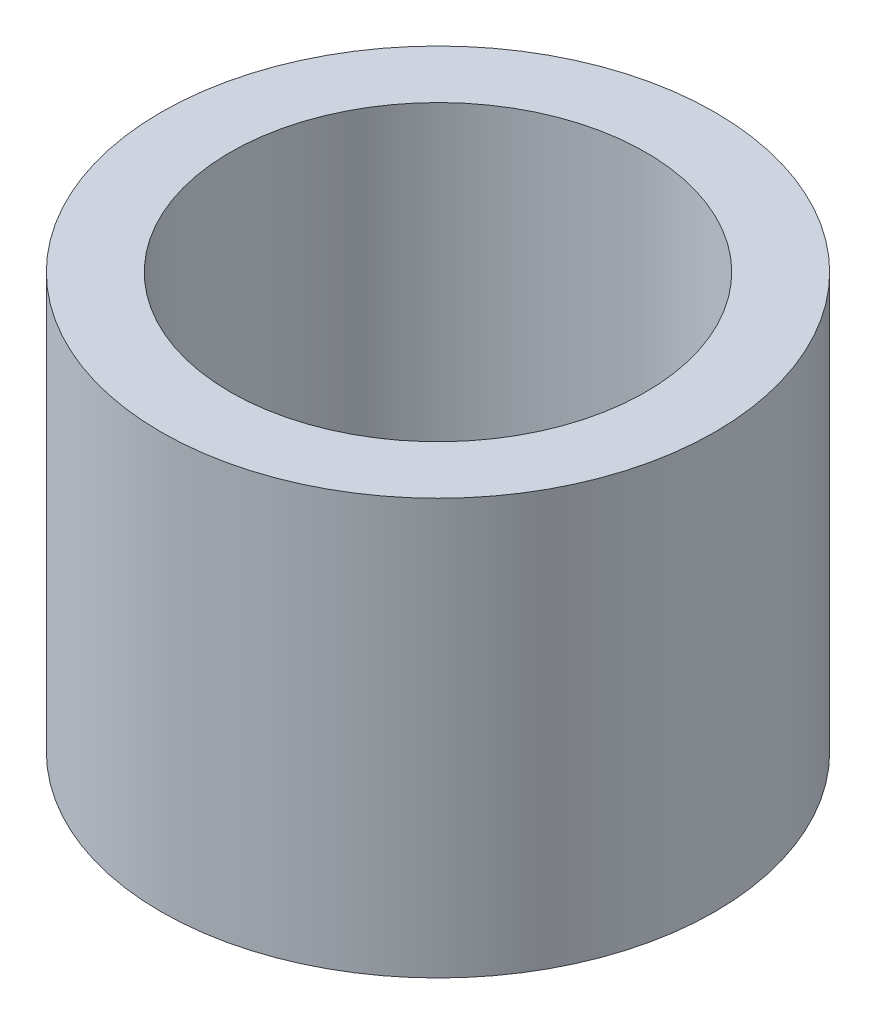
ISO-10303-21;
HEADER;
FILE_DESCRIPTION(('STEP AP214'),'2;1');
FILE_NAME('part.step','',(''),(''),'','','');
FILE_SCHEMA(('AUTOMOTIVE_DESIGN { 1 0 10303 214 1 1 1 1 }'));
ENDSEC;
DATA;
#1=APPLICATION_CONTEXT('core data for automotive mechanical design processes');
#2=APPLICATION_PROTOCOL_DEFINITION('international standard','automotive_design',2000,#1);
#3=PRODUCT_CONTEXT('',#1,'mechanical');
#4=PRODUCT('Part','Part','',(#3));
#5=PRODUCT_RELATED_PRODUCT_CATEGORY('part','',(#4));
#6=PRODUCT_DEFINITION_FORMATION('','',#4);
#7=PRODUCT_DEFINITION_CONTEXT('part definition',#1,'design');
#8=PRODUCT_DEFINITION('design','',#6,#7);
#9=PRODUCT_DEFINITION_SHAPE('','',#8);
#10=(LENGTH_UNIT() NAMED_UNIT(*) SI_UNIT(.MILLI.,.METRE.));
#11=(NAMED_UNIT(*) PLANE_ANGLE_UNIT() SI_UNIT($,.RADIAN.));
#12=(NAMED_UNIT(*) SI_UNIT($,.STERADIAN.) SOLID_ANGLE_UNIT());
#13=UNCERTAINTY_MEASURE_WITH_UNIT(LENGTH_MEASURE(1.E-05),#10,'distance_accuracy_value','');
#14=(GEOMETRIC_REPRESENTATION_CONTEXT(3) GLOBAL_UNCERTAINTY_ASSIGNED_CONTEXT((#13)) GLOBAL_UNIT_ASSIGNED_CONTEXT((#10,
#11,#12)) REPRESENTATION_CONTEXT('',''));
#15=CARTESIAN_POINT('',(0.,0.,0.));
#16=DIRECTION('',(0.,0.,1.));
#17=DIRECTION('',(1.,0.,0.));
#18=AXIS2_PLACEMENT_3D('',#15,#16,#17);
#19=CARTESIAN_POINT('',(0.,38.1,0.));
#20=DIRECTION('',(0.,1.,0.));
#21=DIRECTION('',(0.,0.,1.));
#22=AXIS2_PLACEMENT_3D('',#19,#20,#21);
#23=PLANE('',#22);
#24=CARTESIAN_POINT('',(0.,38.1,0.));
#25=DIRECTION('',(0.,1.,0.));
#26=DIRECTION('',(0.,0.,1.));
#27=AXIS2_PLACEMENT_3D('',#24,#25,#26);
#28=CIRCLE('',#27,25.4);
#29=CARTESIAN_POINT('',(0.,38.1,25.4));
#30=VERTEX_POINT('',#29);
#31=EDGE_CURVE('E10',#30,#30,#28,.T.);
#32=ORIENTED_EDGE('',*,*,#31,.T.);
#33=EDGE_LOOP('',(#32));
#34=FACE_BOUND('',#33,.T.);
#35=CARTESIAN_POINT('',(0.,38.1,0.));
#36=DIRECTION('',(0.,1.,0.));
#37=DIRECTION('',(0.,0.,1.));
#38=AXIS2_PLACEMENT_3D('',#35,#36,#37);
#39=CIRCLE('',#38,19.05);
#40=CARTESIAN_POINT('',(0.,38.1,19.05));
#41=VERTEX_POINT('',#40);
#42=EDGE_CURVE('E43',#41,#41,#39,.T.);
#43=ORIENTED_EDGE('',*,*,#42,.F.);
#44=EDGE_LOOP('',(#43));
#45=FACE_BOUND('',#44,.T.);
#46=ADVANCED_FACE('F32',(#34,#45),#23,.T.);
#47=CARTESIAN_POINT('',(0.,0.,0.));
#48=DIRECTION('',(0.,1.,0.));
#49=DIRECTION('',(0.,0.,1.));
#50=AXIS2_PLACEMENT_3D('',#47,#48,#49);
#51=PLANE('',#50);
#52=CARTESIAN_POINT('',(0.,0.,0.));
#53=DIRECTION('',(0.,1.,0.));
#54=DIRECTION('',(0.,0.,1.));
#55=AXIS2_PLACEMENT_3D('',#52,#53,#54);
#56=CIRCLE('',#55,25.4);
#57=CARTESIAN_POINT('',(0.,0.,25.4));
#58=VERTEX_POINT('',#57);
#59=EDGE_CURVE('E36',#58,#58,#56,.T.);
#60=ORIENTED_EDGE('',*,*,#59,.F.);
#61=EDGE_LOOP('',(#60));
#62=FACE_BOUND('',#61,.T.);
#63=CARTESIAN_POINT('',(0.,0.,0.));
#64=DIRECTION('',(0.,1.,0.));
#65=DIRECTION('',(0.,0.,1.));
#66=AXIS2_PLACEMENT_3D('',#63,#64,#65);
#67=CIRCLE('',#66,19.05);
#68=CARTESIAN_POINT('',(0.,0.,19.05));
#69=VERTEX_POINT('',#68);
#70=EDGE_CURVE('E45',#69,#69,#67,.T.);
#71=ORIENTED_EDGE('',*,*,#70,.T.);
#72=EDGE_LOOP('',(#71));
#73=FACE_BOUND('',#72,.T.);
#74=ADVANCED_FACE('F55',(#62,#73),#51,.F.);
#75=CARTESIAN_POINT('',(0.,38.1,0.));
#76=DIRECTION('',(0.,-1.,0.));
#77=DIRECTION('',(0.,0.,-1.));
#78=AXIS2_PLACEMENT_3D('',#75,#76,#77);
#79=CYLINDRICAL_SURFACE('',#78,25.4);
#80=ORIENTED_EDGE('',*,*,#31,.F.);
#81=EDGE_LOOP('',(#80));
#82=FACE_BOUND('',#81,.T.);
#83=ORIENTED_EDGE('',*,*,#59,.T.);
#84=EDGE_LOOP('',(#83));
#85=FACE_BOUND('',#84,.T.);
#86=ADVANCED_FACE('F34',(#82,#85),#79,.T.);
#87=CARTESIAN_POINT('',(0.,38.1,0.));
#88=DIRECTION('',(0.,-1.,0.));
#89=DIRECTION('',(0.,0.,-1.));
#90=AXIS2_PLACEMENT_3D('',#87,#88,#89);
#91=CYLINDRICAL_SURFACE('',#90,19.05);
#92=ORIENTED_EDGE('',*,*,#42,.T.);
#93=EDGE_LOOP('',(#92));
#94=FACE_BOUND('',#93,.T.);
#95=ORIENTED_EDGE('',*,*,#70,.F.);
#96=EDGE_LOOP('',(#95));
#97=FACE_BOUND('',#96,.T.);
#98=ADVANCED_FACE('F51',(#94,#97),#91,.F.);
#99=CLOSED_SHELL('',(#46,#74,#86,#98));
#100=MANIFOLD_SOLID_BREP('B2',#99);
#101=ADVANCED_BREP_SHAPE_REPRESENTATION('',(#18,#100),#14);
#102=SHAPE_DEFINITION_REPRESENTATION(#9,#101);
ENDSEC;
END-ISO-10303-21;
